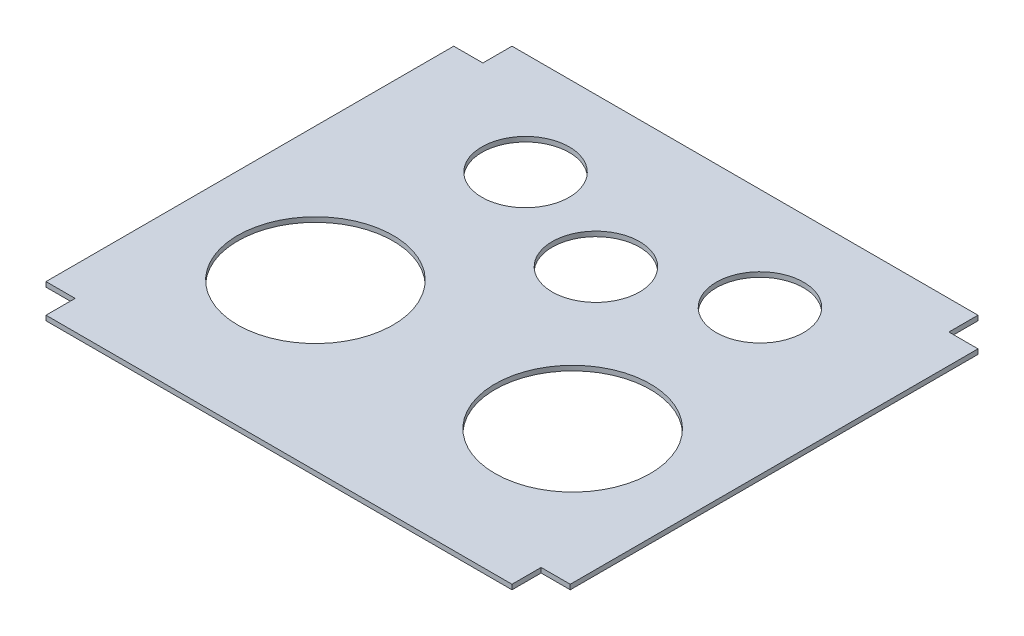
ISO-10303-21;
HEADER;
FILE_DESCRIPTION(('STEP AP214'),'2;1');
FILE_NAME('part.step','',(''),(''),'','','');
FILE_SCHEMA(('AUTOMOTIVE_DESIGN { 1 0 10303 214 1 1 1 1 }'));
ENDSEC;
DATA;
#1=APPLICATION_CONTEXT('core data for automotive mechanical design processes');
#2=APPLICATION_PROTOCOL_DEFINITION('international standard','automotive_design',2000,#1);
#3=PRODUCT_CONTEXT('',#1,'mechanical');
#4=PRODUCT('Part','Part','',(#3));
#5=PRODUCT_RELATED_PRODUCT_CATEGORY('part','',(#4));
#6=PRODUCT_DEFINITION_FORMATION('','',#4);
#7=PRODUCT_DEFINITION_CONTEXT('part definition',#1,'design');
#8=PRODUCT_DEFINITION('design','',#6,#7);
#9=PRODUCT_DEFINITION_SHAPE('','',#8);
#10=(LENGTH_UNIT() NAMED_UNIT(*) SI_UNIT(.MILLI.,.METRE.));
#11=(NAMED_UNIT(*) PLANE_ANGLE_UNIT() SI_UNIT($,.RADIAN.));
#12=(NAMED_UNIT(*) SI_UNIT($,.STERADIAN.) SOLID_ANGLE_UNIT());
#13=UNCERTAINTY_MEASURE_WITH_UNIT(LENGTH_MEASURE(1.E-05),#10,'distance_accuracy_value','');
#14=(GEOMETRIC_REPRESENTATION_CONTEXT(3) GLOBAL_UNCERTAINTY_ASSIGNED_CONTEXT((#13)) GLOBAL_UNIT_ASSIGNED_CONTEXT((#10,
#11,#12)) REPRESENTATION_CONTEXT('',''));
#15=CARTESIAN_POINT('',(0.,0.,0.));
#16=DIRECTION('',(0.,0.,1.));
#17=DIRECTION('',(1.,0.,0.));
#18=AXIS2_PLACEMENT_3D('',#15,#16,#17);
#19=CARTESIAN_POINT('',(0.,6.35,0.));
#20=DIRECTION('',(0.,1.,0.));
#21=DIRECTION('',(0.,0.,1.));
#22=AXIS2_PLACEMENT_3D('',#19,#20,#21);
#23=PLANE('',#22);
#24=CARTESIAN_POINT('',(-151.485932588895,6.35,-437.719781848305));
#25=DIRECTION('',(0.,1.,0.));
#26=DIRECTION('',(0.,0.,1.));
#27=AXIS2_PLACEMENT_3D('',#24,#25,#26);
#28=CIRCLE('',#27,57.15);
#29=CARTESIAN_POINT('',(-151.485932588895,6.35,-380.569781848305));
#30=VERTEX_POINT('',#29);
#31=EDGE_CURVE('E338',#30,#30,#28,.T.);
#32=ORIENTED_EDGE('',*,*,#31,.F.);
#33=EDGE_LOOP('',(#32));
#34=FACE_BOUND('',#33,.T.);
#35=CARTESIAN_POINT('',(-136.525,6.35,-177.8));
#36=DIRECTION('',(0.,1.,0.));
#37=DIRECTION('',(0.,0.,1.));
#38=AXIS2_PLACEMENT_3D('',#35,#36,#37);
#39=CIRCLE('',#38,101.6);
#40=CARTESIAN_POINT('',(-136.525,6.35,-76.1999999999999));
#41=VERTEX_POINT('',#40);
#42=EDGE_CURVE('E354',#41,#41,#39,.T.);
#43=ORIENTED_EDGE('',*,*,#42,.F.);
#44=EDGE_LOOP('',(#43));
#45=FACE_BOUND('',#44,.T.);
#46=DIRECTION('',(1.,0.,0.));
#47=VECTOR('',#46,1.);
#48=CARTESIAN_POINT('',(38.1,6.35,0.));
#49=LINE('',#48,#47);
#50=CARTESIAN_POINT('',(0.,6.35,0.));
#51=VERTEX_POINT('',#50);
#52=CARTESIAN_POINT('',(38.1,6.35,0.));
#53=VERTEX_POINT('',#52);
#54=EDGE_CURVE('E202',#51,#53,#49,.T.);
#55=ORIENTED_EDGE('',*,*,#54,.T.);
#56=DIRECTION('',(0.,0.,-1.));
#57=VECTOR('',#56,1.);
#58=CARTESIAN_POINT('',(38.0999999999999,6.35,-533.4));
#59=LINE('',#58,#57);
#60=CARTESIAN_POINT('',(38.0999999999999,6.35,-533.4));
#61=VERTEX_POINT('',#60);
#62=EDGE_CURVE('E114',#53,#61,#59,.T.);
#63=ORIENTED_EDGE('',*,*,#62,.T.);
#64=DIRECTION('',(-1.,0.,0.));
#65=VECTOR('',#64,1.);
#66=CARTESIAN_POINT('',(0.,6.35,-533.4));
#67=LINE('',#66,#65);
#68=CARTESIAN_POINT('',(0.,6.35,-533.4));
#69=VERTEX_POINT('',#68);
#70=EDGE_CURVE('E239',#61,#69,#67,.T.);
#71=ORIENTED_EDGE('',*,*,#70,.T.);
#72=DIRECTION('',(0.,0.,-1.));
#73=VECTOR('',#72,1.);
#74=CARTESIAN_POINT('',(0.,6.35,-571.5));
#75=LINE('',#74,#73);
#76=CARTESIAN_POINT('',(0.,6.35,-571.5));
#77=VERTEX_POINT('',#76);
#78=EDGE_CURVE('E259',#69,#77,#75,.T.);
#79=ORIENTED_EDGE('',*,*,#78,.T.);
#80=DIRECTION('',(-1.,0.,0.));
#81=VECTOR('',#80,1.);
#82=CARTESIAN_POINT('',(-609.6,6.35,-571.5));
#83=LINE('',#82,#81);
#84=CARTESIAN_POINT('',(-609.6,6.35,-571.5));
#85=VERTEX_POINT('',#84);
#86=EDGE_CURVE('E255',#77,#85,#83,.T.);
#87=ORIENTED_EDGE('',*,*,#86,.T.);
#88=DIRECTION('',(0.,0.,1.));
#89=VECTOR('',#88,1.);
#90=CARTESIAN_POINT('',(-609.6,6.35,-533.4));
#91=LINE('',#90,#89);
#92=CARTESIAN_POINT('',(-609.6,6.35,-533.4));
#93=VERTEX_POINT('',#92);
#94=EDGE_CURVE('E258',#85,#93,#91,.T.);
#95=ORIENTED_EDGE('',*,*,#94,.T.);
#96=DIRECTION('',(-1.,0.,0.));
#97=VECTOR('',#96,1.);
#98=CARTESIAN_POINT('',(-647.7,6.35,-533.4));
#99=LINE('',#98,#97);
#100=CARTESIAN_POINT('',(-647.7,6.35,-533.4));
#101=VERTEX_POINT('',#100);
#102=EDGE_CURVE('E263',#93,#101,#99,.T.);
#103=ORIENTED_EDGE('',*,*,#102,.T.);
#104=DIRECTION('',(0.,0.,1.));
#105=VECTOR('',#104,1.);
#106=CARTESIAN_POINT('',(-647.7,6.35,0.));
#107=LINE('',#106,#105);
#108=CARTESIAN_POINT('',(-647.7,6.35,0.));
#109=VERTEX_POINT('',#108);
#110=EDGE_CURVE('E270',#101,#109,#107,.T.);
#111=ORIENTED_EDGE('',*,*,#110,.T.);
#112=DIRECTION('',(1.,0.,0.));
#113=VECTOR('',#112,1.);
#114=CARTESIAN_POINT('',(-609.6,6.35,0.));
#115=LINE('',#114,#113);
#116=CARTESIAN_POINT('',(-609.6,6.35,0.));
#117=VERTEX_POINT('',#116);
#118=EDGE_CURVE('E145',#109,#117,#115,.T.);
#119=ORIENTED_EDGE('',*,*,#118,.T.);
#120=DIRECTION('',(0.,0.,1.));
#121=VECTOR('',#120,1.);
#122=CARTESIAN_POINT('',(-609.6,6.35,38.1000000000001));
#123=LINE('',#122,#121);
#124=CARTESIAN_POINT('',(-609.6,6.35,38.1000000000001));
#125=VERTEX_POINT('',#124);
#126=EDGE_CURVE('E139',#117,#125,#123,.T.);
#127=ORIENTED_EDGE('',*,*,#126,.T.);
#128=DIRECTION('',(1.,0.,0.));
#129=VECTOR('',#128,1.);
#130=CARTESIAN_POINT('',(0.,6.35,38.1));
#131=LINE('',#130,#129);
#132=CARTESIAN_POINT('',(0.,6.35,38.1));
#133=VERTEX_POINT('',#132);
#134=EDGE_CURVE('E143',#125,#133,#131,.T.);
#135=ORIENTED_EDGE('',*,*,#134,.T.);
#136=DIRECTION('',(0.,0.,-1.));
#137=VECTOR('',#136,1.);
#138=CARTESIAN_POINT('',(0.,6.35,0.));
#139=LINE('',#138,#137);
#140=EDGE_CURVE('E59',#133,#51,#139,.T.);
#141=ORIENTED_EDGE('',*,*,#140,.T.);
#142=EDGE_LOOP('',(#55,#63,#71,#79,#87,#95,#103,#111,#119,#127,#135,#141));
#143=FACE_BOUND('',#142,.T.);
#144=CARTESIAN_POINT('',(-473.075,6.35,-177.8));
#145=DIRECTION('',(0.,1.,0.));
#146=DIRECTION('',(0.,0.,1.));
#147=AXIS2_PLACEMENT_3D('',#144,#145,#146);
#148=CIRCLE('',#147,101.6);
#149=CARTESIAN_POINT('',(-473.075,6.35,-76.2));
#150=VERTEX_POINT('',#149);
#151=EDGE_CURVE('E172',#150,#150,#148,.T.);
#152=ORIENTED_EDGE('',*,*,#151,.F.);
#153=EDGE_LOOP('',(#152));
#154=FACE_BOUND('',#153,.T.);
#155=CARTESIAN_POINT('',(-304.8,6.35,-376.4596256792));
#156=DIRECTION('',(0.,1.,0.));
#157=DIRECTION('',(0.,0.,1.));
#158=AXIS2_PLACEMENT_3D('',#155,#156,#157);
#159=CIRCLE('',#158,57.15);
#160=CARTESIAN_POINT('',(-304.8,6.35,-319.3096256792));
#161=VERTEX_POINT('',#160);
#162=EDGE_CURVE('E346',#161,#161,#159,.T.);
#163=ORIENTED_EDGE('',*,*,#162,.F.);
#164=EDGE_LOOP('',(#163));
#165=FACE_BOUND('',#164,.T.);
#166=CARTESIAN_POINT('',(-458.114067411105,6.35,-437.719781848305));
#167=DIRECTION('',(0.,1.,0.));
#168=DIRECTION('',(0.,0.,1.));
#169=AXIS2_PLACEMENT_3D('',#166,#167,#168);
#170=CIRCLE('',#169,57.15);
#171=CARTESIAN_POINT('',(-458.114067411105,6.35,-380.569781848305));
#172=VERTEX_POINT('',#171);
#173=EDGE_CURVE('E327',#172,#172,#170,.T.);
#174=ORIENTED_EDGE('',*,*,#173,.F.);
#175=EDGE_LOOP('',(#174));
#176=FACE_BOUND('',#175,.T.);
#177=ADVANCED_FACE('F41',(#34,#45,#143,#154,#165,#176),#23,.T.);
#178=CARTESIAN_POINT('',(0.,0.,0.));
#179=DIRECTION('',(0.,1.,0.));
#180=DIRECTION('',(0.,0.,1.));
#181=AXIS2_PLACEMENT_3D('',#178,#179,#180);
#182=PLANE('',#181);
#183=DIRECTION('',(1.,0.,0.));
#184=VECTOR('',#183,1.);
#185=CARTESIAN_POINT('',(38.1,0.,0.));
#186=LINE('',#185,#184);
#187=CARTESIAN_POINT('',(0.,0.,0.));
#188=VERTEX_POINT('',#187);
#189=CARTESIAN_POINT('',(38.1,0.,0.));
#190=VERTEX_POINT('',#189);
#191=EDGE_CURVE('E167',#188,#190,#186,.T.);
#192=ORIENTED_EDGE('',*,*,#191,.F.);
#193=DIRECTION('',(0.,0.,-1.));
#194=VECTOR('',#193,1.);
#195=CARTESIAN_POINT('',(0.,0.,0.));
#196=LINE('',#195,#194);
#197=CARTESIAN_POINT('',(0.,0.,38.1));
#198=VERTEX_POINT('',#197);
#199=EDGE_CURVE('E106',#198,#188,#196,.T.);
#200=ORIENTED_EDGE('',*,*,#199,.F.);
#201=DIRECTION('',(1.,0.,0.));
#202=VECTOR('',#201,1.);
#203=CARTESIAN_POINT('',(0.,0.,38.1));
#204=LINE('',#203,#202);
#205=CARTESIAN_POINT('',(-609.6,0.,38.1000000000001));
#206=VERTEX_POINT('',#205);
#207=EDGE_CURVE('E100',#206,#198,#204,.T.);
#208=ORIENTED_EDGE('',*,*,#207,.F.);
#209=DIRECTION('',(0.,0.,1.));
#210=VECTOR('',#209,1.);
#211=CARTESIAN_POINT('',(-609.6,0.,38.1000000000001));
#212=LINE('',#211,#210);
#213=CARTESIAN_POINT('',(-609.6,0.,0.));
#214=VERTEX_POINT('',#213);
#215=EDGE_CURVE('E154',#214,#206,#212,.T.);
#216=ORIENTED_EDGE('',*,*,#215,.F.);
#217=DIRECTION('',(1.,0.,0.));
#218=VECTOR('',#217,1.);
#219=CARTESIAN_POINT('',(-609.6,0.,0.));
#220=LINE('',#219,#218);
#221=CARTESIAN_POINT('',(-647.7,0.,0.));
#222=VERTEX_POINT('',#221);
#223=EDGE_CURVE('E193',#222,#214,#220,.T.);
#224=ORIENTED_EDGE('',*,*,#223,.F.);
#225=DIRECTION('',(0.,0.,1.));
#226=VECTOR('',#225,1.);
#227=CARTESIAN_POINT('',(-647.7,0.,0.));
#228=LINE('',#227,#226);
#229=CARTESIAN_POINT('',(-647.7,0.,-533.4));
#230=VERTEX_POINT('',#229);
#231=EDGE_CURVE('E190',#230,#222,#228,.T.);
#232=ORIENTED_EDGE('',*,*,#231,.F.);
#233=DIRECTION('',(-1.,0.,0.));
#234=VECTOR('',#233,1.);
#235=CARTESIAN_POINT('',(-647.7,0.,-533.4));
#236=LINE('',#235,#234);
#237=CARTESIAN_POINT('',(-609.6,0.,-533.4));
#238=VERTEX_POINT('',#237);
#239=EDGE_CURVE('E187',#238,#230,#236,.T.);
#240=ORIENTED_EDGE('',*,*,#239,.F.);
#241=DIRECTION('',(0.,0.,1.));
#242=VECTOR('',#241,1.);
#243=CARTESIAN_POINT('',(-609.6,0.,-533.4));
#244=LINE('',#243,#242);
#245=CARTESIAN_POINT('',(-609.6,0.,-571.5));
#246=VERTEX_POINT('',#245);
#247=EDGE_CURVE('E184',#246,#238,#244,.T.);
#248=ORIENTED_EDGE('',*,*,#247,.F.);
#249=DIRECTION('',(-1.,0.,0.));
#250=VECTOR('',#249,1.);
#251=CARTESIAN_POINT('',(-609.6,0.,-571.5));
#252=LINE('',#251,#250);
#253=CARTESIAN_POINT('',(0.,0.,-571.5));
#254=VERTEX_POINT('',#253);
#255=EDGE_CURVE('E181',#254,#246,#252,.T.);
#256=ORIENTED_EDGE('',*,*,#255,.F.);
#257=DIRECTION('',(0.,0.,-1.));
#258=VECTOR('',#257,1.);
#259=CARTESIAN_POINT('',(0.,0.,-571.5));
#260=LINE('',#259,#258);
#261=CARTESIAN_POINT('',(0.,0.,-533.4));
#262=VERTEX_POINT('',#261);
#263=EDGE_CURVE('E178',#262,#254,#260,.T.);
#264=ORIENTED_EDGE('',*,*,#263,.F.);
#265=DIRECTION('',(-1.,0.,0.));
#266=VECTOR('',#265,1.);
#267=CARTESIAN_POINT('',(0.,0.,-533.4));
#268=LINE('',#267,#266);
#269=CARTESIAN_POINT('',(38.0999999999999,0.,-533.4));
#270=VERTEX_POINT('',#269);
#271=EDGE_CURVE('E175',#270,#262,#268,.T.);
#272=ORIENTED_EDGE('',*,*,#271,.F.);
#273=DIRECTION('',(0.,0.,-1.));
#274=VECTOR('',#273,1.);
#275=CARTESIAN_POINT('',(38.0999999999999,0.,-533.4));
#276=LINE('',#275,#274);
#277=EDGE_CURVE('E171',#190,#270,#276,.T.);
#278=ORIENTED_EDGE('',*,*,#277,.F.);
#279=EDGE_LOOP('',(#192,#200,#208,#216,#224,#232,#240,#248,#256,#264,#272,#278));
#280=FACE_BOUND('',#279,.T.);
#281=CARTESIAN_POINT('',(-473.075,0.,-177.8));
#282=DIRECTION('',(0.,1.,0.));
#283=DIRECTION('',(0.,0.,1.));
#284=AXIS2_PLACEMENT_3D('',#281,#282,#283);
#285=CIRCLE('',#284,101.6);
#286=CARTESIAN_POINT('',(-473.075,0.,-76.2));
#287=VERTEX_POINT('',#286);
#288=EDGE_CURVE('E358',#287,#287,#285,.T.);
#289=ORIENTED_EDGE('',*,*,#288,.T.);
#290=EDGE_LOOP('',(#289));
#291=FACE_BOUND('',#290,.T.);
#292=CARTESIAN_POINT('',(-136.525,0.,-177.8));
#293=DIRECTION('',(0.,1.,0.));
#294=DIRECTION('',(0.,0.,1.));
#295=AXIS2_PLACEMENT_3D('',#292,#293,#294);
#296=CIRCLE('',#295,101.6);
#297=CARTESIAN_POINT('',(-136.525,0.,-76.1999999999999));
#298=VERTEX_POINT('',#297);
#299=EDGE_CURVE('E350',#298,#298,#296,.T.);
#300=ORIENTED_EDGE('',*,*,#299,.T.);
#301=EDGE_LOOP('',(#300));
#302=FACE_BOUND('',#301,.T.);
#303=CARTESIAN_POINT('',(-304.8,0.,-376.4596256792));
#304=DIRECTION('',(0.,1.,0.));
#305=DIRECTION('',(0.,0.,1.));
#306=AXIS2_PLACEMENT_3D('',#303,#304,#305);
#307=CIRCLE('',#306,57.15);
#308=CARTESIAN_POINT('',(-304.8,0.,-319.3096256792));
#309=VERTEX_POINT('',#308);
#310=EDGE_CURVE('E342',#309,#309,#307,.T.);
#311=ORIENTED_EDGE('',*,*,#310,.T.);
#312=EDGE_LOOP('',(#311));
#313=FACE_BOUND('',#312,.T.);
#314=CARTESIAN_POINT('',(-151.485932588895,0.,-437.719781848305));
#315=DIRECTION('',(0.,1.,0.));
#316=DIRECTION('',(0.,0.,1.));
#317=AXIS2_PLACEMENT_3D('',#314,#315,#316);
#318=CIRCLE('',#317,57.15);
#319=CARTESIAN_POINT('',(-151.485932588895,0.,-380.569781848305));
#320=VERTEX_POINT('',#319);
#321=EDGE_CURVE('E335',#320,#320,#318,.T.);
#322=ORIENTED_EDGE('',*,*,#321,.T.);
#323=EDGE_LOOP('',(#322));
#324=FACE_BOUND('',#323,.T.);
#325=CARTESIAN_POINT('',(-458.114067411105,0.,-437.719781848305));
#326=DIRECTION('',(0.,1.,0.));
#327=DIRECTION('',(0.,0.,1.));
#328=AXIS2_PLACEMENT_3D('',#325,#326,#327);
#329=CIRCLE('',#328,57.15);
#330=CARTESIAN_POINT('',(-458.114067411105,0.,-380.569781848305));
#331=VERTEX_POINT('',#330);
#332=EDGE_CURVE('E330',#331,#331,#329,.T.);
#333=ORIENTED_EDGE('',*,*,#332,.T.);
#334=EDGE_LOOP('',(#333));
#335=FACE_BOUND('',#334,.T.);
#336=ADVANCED_FACE('F243',(#280,#291,#302,#313,#324,#335),#182,.F.);
#337=CARTESIAN_POINT('',(38.1,6.35,0.));
#338=DIRECTION('',(0.,0.,-1.));
#339=DIRECTION('',(-1.,0.,0.));
#340=AXIS2_PLACEMENT_3D('',#337,#338,#339);
#341=PLANE('',#340);
#342=ORIENTED_EDGE('',*,*,#191,.T.);
#343=DIRECTION('',(0.,-1.,0.));
#344=VECTOR('',#343,1.);
#345=CARTESIAN_POINT('',(38.1,6.35,0.));
#346=LINE('',#345,#344);
#347=EDGE_CURVE('E11',#53,#190,#346,.T.);
#348=ORIENTED_EDGE('',*,*,#347,.F.);
#349=ORIENTED_EDGE('',*,*,#54,.F.);
#350=DIRECTION('',(0.,-1.,0.));
#351=VECTOR('',#350,1.);
#352=CARTESIAN_POINT('',(0.,6.35,0.));
#353=LINE('',#352,#351);
#354=EDGE_CURVE('E163',#51,#188,#353,.T.);
#355=ORIENTED_EDGE('',*,*,#354,.T.);
#356=EDGE_LOOP('',(#342,#348,#349,#355));
#357=FACE_BOUND('',#356,.T.);
#358=ADVANCED_FACE('F43',(#357),#341,.F.);
#359=CARTESIAN_POINT('',(38.0999999999999,6.35,-533.4));
#360=DIRECTION('',(-1.,0.,0.));
#361=DIRECTION('',(0.,0.,1.));
#362=AXIS2_PLACEMENT_3D('',#359,#360,#361);
#363=PLANE('',#362);
#364=ORIENTED_EDGE('',*,*,#277,.T.);
#365=DIRECTION('',(0.,-1.,0.));
#366=VECTOR('',#365,1.);
#367=CARTESIAN_POINT('',(38.0999999999999,6.35,-533.4));
#368=LINE('',#367,#366);
#369=EDGE_CURVE('E51',#61,#270,#368,.T.);
#370=ORIENTED_EDGE('',*,*,#369,.F.);
#371=ORIENTED_EDGE('',*,*,#62,.F.);
#372=ORIENTED_EDGE('',*,*,#347,.T.);
#373=EDGE_LOOP('',(#364,#370,#371,#372));
#374=FACE_BOUND('',#373,.T.);
#375=ADVANCED_FACE('F483',(#374),#363,.F.);
#376=CARTESIAN_POINT('',(0.,6.35,-533.4));
#377=DIRECTION('',(0.,0.,1.));
#378=DIRECTION('',(1.,0.,0.));
#379=AXIS2_PLACEMENT_3D('',#376,#377,#378);
#380=PLANE('',#379);
#381=ORIENTED_EDGE('',*,*,#271,.T.);
#382=DIRECTION('',(0.,-1.,0.));
#383=VECTOR('',#382,1.);
#384=CARTESIAN_POINT('',(0.,6.35,-533.4));
#385=LINE('',#384,#383);
#386=EDGE_CURVE('E229',#69,#262,#385,.T.);
#387=ORIENTED_EDGE('',*,*,#386,.F.);
#388=ORIENTED_EDGE('',*,*,#70,.F.);
#389=ORIENTED_EDGE('',*,*,#369,.T.);
#390=EDGE_LOOP('',(#381,#387,#388,#389));
#391=FACE_BOUND('',#390,.T.);
#392=ADVANCED_FACE('F237',(#391),#380,.F.);
#393=CARTESIAN_POINT('',(0.,6.35,-571.5));
#394=DIRECTION('',(-1.,0.,0.));
#395=DIRECTION('',(0.,0.,1.));
#396=AXIS2_PLACEMENT_3D('',#393,#394,#395);
#397=PLANE('',#396);
#398=ORIENTED_EDGE('',*,*,#263,.T.);
#399=DIRECTION('',(0.,-1.,0.));
#400=VECTOR('',#399,1.);
#401=CARTESIAN_POINT('',(0.,6.35,-571.5));
#402=LINE('',#401,#400);
#403=EDGE_CURVE('E225',#77,#254,#402,.T.);
#404=ORIENTED_EDGE('',*,*,#403,.F.);
#405=ORIENTED_EDGE('',*,*,#78,.F.);
#406=ORIENTED_EDGE('',*,*,#386,.T.);
#407=EDGE_LOOP('',(#398,#404,#405,#406));
#408=FACE_BOUND('',#407,.T.);
#409=ADVANCED_FACE('F249',(#408),#397,.F.);
#410=CARTESIAN_POINT('',(-609.6,6.35,-571.5));
#411=DIRECTION('',(0.,0.,1.));
#412=DIRECTION('',(1.,0.,0.));
#413=AXIS2_PLACEMENT_3D('',#410,#411,#412);
#414=PLANE('',#413);
#415=ORIENTED_EDGE('',*,*,#255,.T.);
#416=DIRECTION('',(0.,-1.,0.));
#417=VECTOR('',#416,1.);
#418=CARTESIAN_POINT('',(-609.6,6.35,-571.5));
#419=LINE('',#418,#417);
#420=EDGE_CURVE('E221',#85,#246,#419,.T.);
#421=ORIENTED_EDGE('',*,*,#420,.F.);
#422=ORIENTED_EDGE('',*,*,#86,.F.);
#423=ORIENTED_EDGE('',*,*,#403,.T.);
#424=EDGE_LOOP('',(#415,#421,#422,#423));
#425=FACE_BOUND('',#424,.T.);
#426=ADVANCED_FACE('F253',(#425),#414,.F.);
#427=CARTESIAN_POINT('',(-609.6,6.35,-533.4));
#428=DIRECTION('',(1.,0.,0.));
#429=DIRECTION('',(0.,0.,-1.));
#430=AXIS2_PLACEMENT_3D('',#427,#428,#429);
#431=PLANE('',#430);
#432=ORIENTED_EDGE('',*,*,#247,.T.);
#433=DIRECTION('',(0.,-1.,0.));
#434=VECTOR('',#433,1.);
#435=CARTESIAN_POINT('',(-609.6,6.35,-533.4));
#436=LINE('',#435,#434);
#437=EDGE_CURVE('E217',#93,#238,#436,.T.);
#438=ORIENTED_EDGE('',*,*,#437,.F.);
#439=ORIENTED_EDGE('',*,*,#94,.F.);
#440=ORIENTED_EDGE('',*,*,#420,.T.);
#441=EDGE_LOOP('',(#432,#438,#439,#440));
#442=FACE_BOUND('',#441,.T.);
#443=ADVANCED_FACE('F448',(#442),#431,.F.);
#444=CARTESIAN_POINT('',(-647.7,6.35,-533.4));
#445=DIRECTION('',(0.,0.,1.));
#446=DIRECTION('',(1.,0.,0.));
#447=AXIS2_PLACEMENT_3D('',#444,#445,#446);
#448=PLANE('',#447);
#449=ORIENTED_EDGE('',*,*,#239,.T.);
#450=DIRECTION('',(0.,-1.,0.));
#451=VECTOR('',#450,1.);
#452=CARTESIAN_POINT('',(-647.7,6.35,-533.4));
#453=LINE('',#452,#451);
#454=EDGE_CURVE('E213',#101,#230,#453,.T.);
#455=ORIENTED_EDGE('',*,*,#454,.F.);
#456=ORIENTED_EDGE('',*,*,#102,.F.);
#457=ORIENTED_EDGE('',*,*,#437,.T.);
#458=EDGE_LOOP('',(#449,#455,#456,#457));
#459=FACE_BOUND('',#458,.T.);
#460=ADVANCED_FACE('F439',(#459),#448,.F.);
#461=CARTESIAN_POINT('',(-647.7,6.35,0.));
#462=DIRECTION('',(1.,0.,0.));
#463=DIRECTION('',(0.,0.,-1.));
#464=AXIS2_PLACEMENT_3D('',#461,#462,#463);
#465=PLANE('',#464);
#466=ORIENTED_EDGE('',*,*,#231,.T.);
#467=DIRECTION('',(0.,-1.,0.));
#468=VECTOR('',#467,1.);
#469=CARTESIAN_POINT('',(-647.7,6.35,0.));
#470=LINE('',#469,#468);
#471=EDGE_CURVE('E209',#109,#222,#470,.T.);
#472=ORIENTED_EDGE('',*,*,#471,.F.);
#473=ORIENTED_EDGE('',*,*,#110,.F.);
#474=ORIENTED_EDGE('',*,*,#454,.T.);
#475=EDGE_LOOP('',(#466,#472,#473,#474));
#476=FACE_BOUND('',#475,.T.);
#477=ADVANCED_FACE('F278',(#476),#465,.F.);
#478=CARTESIAN_POINT('',(-609.6,6.35,0.));
#479=DIRECTION('',(0.,0.,-1.));
#480=DIRECTION('',(-1.,0.,0.));
#481=AXIS2_PLACEMENT_3D('',#478,#479,#480);
#482=PLANE('',#481);
#483=ORIENTED_EDGE('',*,*,#223,.T.);
#484=DIRECTION('',(0.,-1.,0.));
#485=VECTOR('',#484,1.);
#486=CARTESIAN_POINT('',(-609.6,6.35,0.));
#487=LINE('',#486,#485);
#488=EDGE_CURVE('E156',#117,#214,#487,.T.);
#489=ORIENTED_EDGE('',*,*,#488,.F.);
#490=ORIENTED_EDGE('',*,*,#118,.F.);
#491=ORIENTED_EDGE('',*,*,#471,.T.);
#492=EDGE_LOOP('',(#483,#489,#490,#491));
#493=FACE_BOUND('',#492,.T.);
#494=ADVANCED_FACE('F282',(#493),#482,.F.);
#495=CARTESIAN_POINT('',(-609.6,6.35,38.1000000000001));
#496=DIRECTION('',(1.,0.,0.));
#497=DIRECTION('',(0.,0.,-1.));
#498=AXIS2_PLACEMENT_3D('',#495,#496,#497);
#499=PLANE('',#498);
#500=ORIENTED_EDGE('',*,*,#215,.T.);
#501=DIRECTION('',(0.,-1.,0.));
#502=VECTOR('',#501,1.);
#503=CARTESIAN_POINT('',(-609.6,6.35,38.1000000000001));
#504=LINE('',#503,#502);
#505=EDGE_CURVE('E151',#125,#206,#504,.T.);
#506=ORIENTED_EDGE('',*,*,#505,.F.);
#507=ORIENTED_EDGE('',*,*,#126,.F.);
#508=ORIENTED_EDGE('',*,*,#488,.T.);
#509=EDGE_LOOP('',(#500,#506,#507,#508));
#510=FACE_BOUND('',#509,.T.);
#511=ADVANCED_FACE('F152',(#510),#499,.F.);
#512=CARTESIAN_POINT('',(0.,6.35,38.1));
#513=DIRECTION('',(0.,0.,-1.));
#514=DIRECTION('',(-1.,0.,0.));
#515=AXIS2_PLACEMENT_3D('',#512,#513,#514);
#516=PLANE('',#515);
#517=ORIENTED_EDGE('',*,*,#207,.T.);
#518=DIRECTION('',(0.,-1.,0.));
#519=VECTOR('',#518,1.);
#520=CARTESIAN_POINT('',(0.,6.35,38.1));
#521=LINE('',#520,#519);
#522=EDGE_CURVE('E157',#133,#198,#521,.T.);
#523=ORIENTED_EDGE('',*,*,#522,.F.);
#524=ORIENTED_EDGE('',*,*,#134,.F.);
#525=ORIENTED_EDGE('',*,*,#505,.T.);
#526=EDGE_LOOP('',(#517,#523,#524,#525));
#527=FACE_BOUND('',#526,.T.);
#528=ADVANCED_FACE('F159',(#527),#516,.F.);
#529=CARTESIAN_POINT('',(0.,6.35,0.));
#530=DIRECTION('',(-1.,0.,0.));
#531=DIRECTION('',(0.,0.,1.));
#532=AXIS2_PLACEMENT_3D('',#529,#530,#531);
#533=PLANE('',#532);
#534=ORIENTED_EDGE('',*,*,#199,.T.);
#535=ORIENTED_EDGE('',*,*,#354,.F.);
#536=ORIENTED_EDGE('',*,*,#140,.F.);
#537=ORIENTED_EDGE('',*,*,#522,.T.);
#538=EDGE_LOOP('',(#534,#535,#536,#537));
#539=FACE_BOUND('',#538,.T.);
#540=ADVANCED_FACE('F286',(#539),#533,.F.);
#541=CARTESIAN_POINT('',(-473.075,6.35,-177.8));
#542=DIRECTION('',(0.,-1.,0.));
#543=DIRECTION('',(0.,0.,-1.));
#544=AXIS2_PLACEMENT_3D('',#541,#542,#543);
#545=CYLINDRICAL_SURFACE('',#544,101.6);
#546=ORIENTED_EDGE('',*,*,#151,.T.);
#547=EDGE_LOOP('',(#546));
#548=FACE_BOUND('',#547,.T.);
#549=ORIENTED_EDGE('',*,*,#288,.F.);
#550=EDGE_LOOP('',(#549));
#551=FACE_BOUND('',#550,.T.);
#552=ADVANCED_FACE('F288',(#548,#551),#545,.F.);
#553=CARTESIAN_POINT('',(-136.525,6.35,-177.8));
#554=DIRECTION('',(0.,-1.,0.));
#555=DIRECTION('',(0.,0.,-1.));
#556=AXIS2_PLACEMENT_3D('',#553,#554,#555);
#557=CYLINDRICAL_SURFACE('',#556,101.6);
#558=ORIENTED_EDGE('',*,*,#42,.T.);
#559=EDGE_LOOP('',(#558));
#560=FACE_BOUND('',#559,.T.);
#561=ORIENTED_EDGE('',*,*,#299,.F.);
#562=EDGE_LOOP('',(#561));
#563=FACE_BOUND('',#562,.T.);
#564=ADVANCED_FACE('F294',(#560,#563),#557,.F.);
#565=CARTESIAN_POINT('',(-304.8,6.35,-376.4596256792));
#566=DIRECTION('',(0.,-1.,0.));
#567=DIRECTION('',(0.,0.,-1.));
#568=AXIS2_PLACEMENT_3D('',#565,#566,#567);
#569=CYLINDRICAL_SURFACE('',#568,57.15);
#570=ORIENTED_EDGE('',*,*,#162,.T.);
#571=EDGE_LOOP('',(#570));
#572=FACE_BOUND('',#571,.T.);
#573=ORIENTED_EDGE('',*,*,#310,.F.);
#574=EDGE_LOOP('',(#573));
#575=FACE_BOUND('',#574,.T.);
#576=ADVANCED_FACE('F310',(#572,#575),#569,.F.);
#577=CARTESIAN_POINT('',(-151.485932588895,6.35,-437.719781848305));
#578=DIRECTION('',(0.,-1.,0.));
#579=DIRECTION('',(0.,0.,-1.));
#580=AXIS2_PLACEMENT_3D('',#577,#578,#579);
#581=CYLINDRICAL_SURFACE('',#580,57.15);
#582=ORIENTED_EDGE('',*,*,#31,.T.);
#583=EDGE_LOOP('',(#582));
#584=FACE_BOUND('',#583,.T.);
#585=ORIENTED_EDGE('',*,*,#321,.F.);
#586=EDGE_LOOP('',(#585));
#587=FACE_BOUND('',#586,.T.);
#588=ADVANCED_FACE('F314',(#584,#587),#581,.F.);
#589=CARTESIAN_POINT('',(-458.114067411105,6.35,-437.719781848305));
#590=DIRECTION('',(0.,-1.,0.));
#591=DIRECTION('',(0.,0.,-1.));
#592=AXIS2_PLACEMENT_3D('',#589,#590,#591);
#593=CYLINDRICAL_SURFACE('',#592,57.15);
#594=ORIENTED_EDGE('',*,*,#173,.T.);
#595=EDGE_LOOP('',(#594));
#596=FACE_BOUND('',#595,.T.);
#597=ORIENTED_EDGE('',*,*,#332,.F.);
#598=EDGE_LOOP('',(#597));
#599=FACE_BOUND('',#598,.T.);
#600=ADVANCED_FACE('F318',(#596,#599),#593,.F.);
#601=CLOSED_SHELL('',(#177,#336,#358,#375,#392,#409,#426,#443,#460,#477,#494,#511,#528,#540,
#552,#564,#576,#588,#600));
#602=MANIFOLD_SOLID_BREP('B2',#601);
#603=ADVANCED_BREP_SHAPE_REPRESENTATION('',(#18,#602),#14);
#604=SHAPE_DEFINITION_REPRESENTATION(#9,#603);
ENDSEC;
END-ISO-10303-21;
